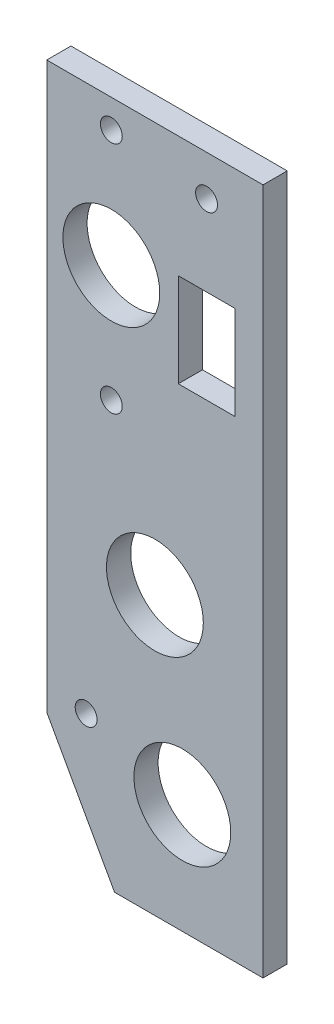
ISO-10303-21;
HEADER;
FILE_DESCRIPTION(('STEP AP214'),'2;1');
FILE_NAME('part.step','',(''),(''),'','','');
FILE_SCHEMA(('AUTOMOTIVE_DESIGN { 1 0 10303 214 1 1 1 1 }'));
ENDSEC;
DATA;
#1=APPLICATION_CONTEXT('core data for automotive mechanical design processes');
#2=APPLICATION_PROTOCOL_DEFINITION('international standard','automotive_design',2000,#1);
#3=PRODUCT_CONTEXT('',#1,'mechanical');
#4=PRODUCT('Part','Part','',(#3));
#5=PRODUCT_RELATED_PRODUCT_CATEGORY('part','',(#4));
#6=PRODUCT_DEFINITION_FORMATION('','',#4);
#7=PRODUCT_DEFINITION_CONTEXT('part definition',#1,'design');
#8=PRODUCT_DEFINITION('design','',#6,#7);
#9=PRODUCT_DEFINITION_SHAPE('','',#8);
#10=(LENGTH_UNIT() NAMED_UNIT(*) SI_UNIT(.MILLI.,.METRE.));
#11=(NAMED_UNIT(*) PLANE_ANGLE_UNIT() SI_UNIT($,.RADIAN.));
#12=(NAMED_UNIT(*) SI_UNIT($,.STERADIAN.) SOLID_ANGLE_UNIT());
#13=UNCERTAINTY_MEASURE_WITH_UNIT(LENGTH_MEASURE(1.E-05),#10,'distance_accuracy_value','');
#14=(GEOMETRIC_REPRESENTATION_CONTEXT(3) GLOBAL_UNCERTAINTY_ASSIGNED_CONTEXT((#13)) GLOBAL_UNIT_ASSIGNED_CONTEXT((#10,
#11,#12)) REPRESENTATION_CONTEXT('',''));
#15=CARTESIAN_POINT('',(0.,0.,0.));
#16=DIRECTION('',(0.,0.,1.));
#17=DIRECTION('',(1.,0.,0.));
#18=AXIS2_PLACEMENT_3D('',#15,#16,#17);
#19=CARTESIAN_POINT('',(-44.1325,26.9875,4.7625));
#20=DIRECTION('',(1.,0.,0.));
#21=DIRECTION('',(0.,1.,0.));
#22=AXIS2_PLACEMENT_3D('',#19,#20,#21);
#23=PLANE('',#22);
#24=DIRECTION('',(0.,-1.,0.));
#25=VECTOR('',#24,1.);
#26=CARTESIAN_POINT('',(-44.1325,26.9875,0.));
#27=LINE('',#26,#25);
#28=CARTESIAN_POINT('',(-44.1325,26.9875,0.));
#29=VERTEX_POINT('',#28);
#30=CARTESIAN_POINT('',(-44.1325,-84.1375,0.));
#31=VERTEX_POINT('',#30);
#32=EDGE_CURVE('E182',#29,#31,#27,.T.);
#33=ORIENTED_EDGE('',*,*,#32,.T.);
#34=DIRECTION('',(0.,0.,-1.));
#35=VECTOR('',#34,1.);
#36=CARTESIAN_POINT('',(-44.1325,-84.1375,4.7625));
#37=LINE('',#36,#35);
#38=CARTESIAN_POINT('',(-44.1325,-84.1375,4.7625));
#39=VERTEX_POINT('',#38);
#40=EDGE_CURVE('E13',#39,#31,#37,.T.);
#41=ORIENTED_EDGE('',*,*,#40,.F.);
#42=DIRECTION('',(0.,-1.,0.));
#43=VECTOR('',#42,1.);
#44=CARTESIAN_POINT('',(-44.1325,26.9875,4.7625));
#45=LINE('',#44,#43);
#46=CARTESIAN_POINT('',(-44.1325,26.9875,4.7625));
#47=VERTEX_POINT('',#46);
#48=EDGE_CURVE('E183',#47,#39,#45,.T.);
#49=ORIENTED_EDGE('',*,*,#48,.F.);
#50=DIRECTION('',(0.,0.,-1.));
#51=VECTOR('',#50,1.);
#52=CARTESIAN_POINT('',(-44.1325,26.9875,4.7625));
#53=LINE('',#52,#51);
#54=EDGE_CURVE('E195',#47,#29,#53,.T.);
#55=ORIENTED_EDGE('',*,*,#54,.T.);
#56=EDGE_LOOP('',(#33,#41,#49,#55));
#57=FACE_BOUND('',#56,.T.);
#58=ADVANCED_FACE('F55',(#57),#23,.F.);
#59=CARTESIAN_POINT('',(-44.1325,-84.1375,4.7625));
#60=DIRECTION('',(0.874157276121538,0.485642931178631,0.));
#61=DIRECTION('',(-0.485642931178631,0.874157276121538,0.));
#62=AXIS2_PLACEMENT_3D('',#59,#60,#61);
#63=PLANE('',#62);
#64=DIRECTION('',(0.485642931178631,-0.874157276121538,0.));
#65=VECTOR('',#64,1.);
#66=CARTESIAN_POINT('',(-44.1325,-84.1375,0.));
#67=LINE('',#66,#65);
#68=CARTESIAN_POINT('',(-30.7975,-108.1405,0.));
#69=VERTEX_POINT('',#68);
#70=EDGE_CURVE('E198',#31,#69,#67,.T.);
#71=ORIENTED_EDGE('',*,*,#70,.T.);
#72=DIRECTION('',(0.,0.,-1.));
#73=VECTOR('',#72,1.);
#74=CARTESIAN_POINT('',(-30.7975,-108.1405,4.7625));
#75=LINE('',#74,#73);
#76=CARTESIAN_POINT('',(-30.7975,-108.1405,4.7625));
#77=VERTEX_POINT('',#76);
#78=EDGE_CURVE('E62',#77,#69,#75,.T.);
#79=ORIENTED_EDGE('',*,*,#78,.F.);
#80=DIRECTION('',(0.485642931178631,-0.874157276121538,0.));
#81=VECTOR('',#80,1.);
#82=CARTESIAN_POINT('',(-44.1325,-84.1375,4.7625));
#83=LINE('',#82,#81);
#84=EDGE_CURVE('E186',#39,#77,#83,.T.);
#85=ORIENTED_EDGE('',*,*,#84,.F.);
#86=ORIENTED_EDGE('',*,*,#40,.T.);
#87=EDGE_LOOP('',(#71,#79,#85,#86));
#88=FACE_BOUND('',#87,.T.);
#89=ADVANCED_FACE('F236',(#88),#63,.F.);
#90=CARTESIAN_POINT('',(-30.7975,-108.1405,4.7625));
#91=DIRECTION('',(0.,1.,0.));
#92=DIRECTION('',(-1.,0.,0.));
#93=AXIS2_PLACEMENT_3D('',#90,#91,#92);
#94=PLANE('',#93);
#95=DIRECTION('',(1.,0.,0.));
#96=VECTOR('',#95,1.);
#97=CARTESIAN_POINT('',(-30.7975,-108.1405,0.));
#98=LINE('',#97,#96);
#99=CARTESIAN_POINT('',(-1.58750000000008,-108.1405,0.));
#100=VERTEX_POINT('',#99);
#101=EDGE_CURVE('E200',#69,#100,#98,.T.);
#102=ORIENTED_EDGE('',*,*,#101,.T.);
#103=DIRECTION('',(0.,0.,-1.));
#104=VECTOR('',#103,1.);
#105=CARTESIAN_POINT('',(-1.58750000000008,-108.1405,4.7625));
#106=LINE('',#105,#104);
#107=CARTESIAN_POINT('',(-1.58750000000008,-108.1405,4.7625));
#108=VERTEX_POINT('',#107);
#109=EDGE_CURVE('E210',#108,#100,#106,.T.);
#110=ORIENTED_EDGE('',*,*,#109,.F.);
#111=DIRECTION('',(1.,0.,0.));
#112=VECTOR('',#111,1.);
#113=CARTESIAN_POINT('',(-30.7975,-108.1405,4.7625));
#114=LINE('',#113,#112);
#115=EDGE_CURVE('E189',#77,#108,#114,.T.);
#116=ORIENTED_EDGE('',*,*,#115,.F.);
#117=ORIENTED_EDGE('',*,*,#78,.T.);
#118=EDGE_LOOP('',(#102,#110,#116,#117));
#119=FACE_BOUND('',#118,.T.);
#120=ADVANCED_FACE('F217',(#119),#94,.F.);
#121=CARTESIAN_POINT('',(-1.58750000000008,-108.1405,4.7625));
#122=DIRECTION('',(-1.,0.,0.));
#123=DIRECTION('',(0.,-1.,0.));
#124=AXIS2_PLACEMENT_3D('',#121,#122,#123);
#125=PLANE('',#124);
#126=DIRECTION('',(0.,1.,0.));
#127=VECTOR('',#126,1.);
#128=CARTESIAN_POINT('',(-1.58750000000008,-108.1405,0.));
#129=LINE('',#128,#127);
#130=CARTESIAN_POINT('',(-1.58750000000001,26.9875,0.));
#131=VERTEX_POINT('',#130);
#132=EDGE_CURVE('E202',#100,#131,#129,.T.);
#133=ORIENTED_EDGE('',*,*,#132,.T.);
#134=DIRECTION('',(0.,0.,-1.));
#135=VECTOR('',#134,1.);
#136=CARTESIAN_POINT('',(-1.58750000000001,26.9875,4.7625));
#137=LINE('',#136,#135);
#138=CARTESIAN_POINT('',(-1.58750000000001,26.9875,4.7625));
#139=VERTEX_POINT('',#138);
#140=EDGE_CURVE('E207',#139,#131,#137,.T.);
#141=ORIENTED_EDGE('',*,*,#140,.F.);
#142=DIRECTION('',(0.,1.,0.));
#143=VECTOR('',#142,1.);
#144=CARTESIAN_POINT('',(-1.58750000000008,-108.1405,4.7625));
#145=LINE('',#144,#143);
#146=EDGE_CURVE('E191',#108,#139,#145,.T.);
#147=ORIENTED_EDGE('',*,*,#146,.F.);
#148=ORIENTED_EDGE('',*,*,#109,.T.);
#149=EDGE_LOOP('',(#133,#141,#147,#148));
#150=FACE_BOUND('',#149,.T.);
#151=ADVANCED_FACE('F226',(#150),#125,.F.);
#152=CARTESIAN_POINT('',(-1.58750000000001,26.9875,4.7625));
#153=DIRECTION('',(0.,-1.,0.));
#154=DIRECTION('',(1.,0.,0.));
#155=AXIS2_PLACEMENT_3D('',#152,#153,#154);
#156=PLANE('',#155);
#157=DIRECTION('',(-1.,0.,0.));
#158=VECTOR('',#157,1.);
#159=CARTESIAN_POINT('',(-1.58750000000001,26.9875,0.));
#160=LINE('',#159,#158);
#161=EDGE_CURVE('E187',#131,#29,#160,.T.);
#162=ORIENTED_EDGE('',*,*,#161,.T.);
#163=ORIENTED_EDGE('',*,*,#54,.F.);
#164=DIRECTION('',(-1.,0.,0.));
#165=VECTOR('',#164,1.);
#166=CARTESIAN_POINT('',(-1.58750000000001,26.9875,4.7625));
#167=LINE('',#166,#165);
#168=EDGE_CURVE('E193',#139,#47,#167,.T.);
#169=ORIENTED_EDGE('',*,*,#168,.F.);
#170=ORIENTED_EDGE('',*,*,#140,.T.);
#171=EDGE_LOOP('',(#162,#163,#169,#170));
#172=FACE_BOUND('',#171,.T.);
#173=ADVANCED_FACE('F230',(#172),#156,.F.);
#174=CARTESIAN_POINT('',(0.,0.,4.7625));
#175=DIRECTION('',(0.,0.,1.));
#176=DIRECTION('',(1.,0.,0.));
#177=AXIS2_PLACEMENT_3D('',#174,#175,#176);
#178=PLANE('',#177);
#179=CARTESIAN_POINT('',(-36.3855,-80.4545,4.7625));
#180=DIRECTION('',(0.,0.,1.));
#181=DIRECTION('',(1.,0.,0.));
#182=AXIS2_PLACEMENT_3D('',#179,#180,#181);
#183=CIRCLE('',#182,2.15265);
#184=CARTESIAN_POINT('',(-34.23285,-80.4545,4.7625));
#185=VERTEX_POINT('',#184);
#186=EDGE_CURVE('E303',#185,#185,#183,.T.);
#187=ORIENTED_EDGE('',*,*,#186,.F.);
#188=EDGE_LOOP('',(#187));
#189=FACE_BOUND('',#188,.T.);
#190=CARTESIAN_POINT('',(-12.7,19.05,4.7625));
#191=DIRECTION('',(0.,0.,1.));
#192=DIRECTION('',(1.,0.,0.));
#193=AXIS2_PLACEMENT_3D('',#190,#191,#192);
#194=CIRCLE('',#193,2.15265);
#195=CARTESIAN_POINT('',(-10.54735,19.05,4.7625));
#196=VERTEX_POINT('',#195);
#197=EDGE_CURVE('E305',#196,#196,#194,.T.);
#198=ORIENTED_EDGE('',*,*,#197,.F.);
#199=EDGE_LOOP('',(#198));
#200=FACE_BOUND('',#199,.T.);
#201=CARTESIAN_POINT('',(-31.4324999999997,21.4047543880437,4.7625));
#202=DIRECTION('',(0.,0.,1.));
#203=DIRECTION('',(1.,0.,0.));
#204=AXIS2_PLACEMENT_3D('',#201,#202,#203);
#205=CIRCLE('',#204,2.15265);
#206=CARTESIAN_POINT('',(-29.2798499999997,21.4047543880437,4.7625));
#207=VERTEX_POINT('',#206);
#208=EDGE_CURVE('E313',#207,#207,#205,.T.);
#209=ORIENTED_EDGE('',*,*,#208,.F.);
#210=EDGE_LOOP('',(#209));
#211=FACE_BOUND('',#210,.T.);
#212=CARTESIAN_POINT('',(-31.4324999999997,-24.6200456119563,4.7625));
#213=DIRECTION('',(0.,0.,1.));
#214=DIRECTION('',(1.,0.,0.));
#215=AXIS2_PLACEMENT_3D('',#212,#213,#214);
#216=CIRCLE('',#215,2.15265);
#217=CARTESIAN_POINT('',(-29.2798499999997,-24.6200456119563,4.7625));
#218=VERTEX_POINT('',#217);
#219=EDGE_CURVE('E318',#218,#218,#216,.T.);
#220=ORIENTED_EDGE('',*,*,#219,.F.);
#221=EDGE_LOOP('',(#220));
#222=FACE_BOUND('',#221,.T.);
#223=DIRECTION('',(0.,-1.,0.));
#224=VECTOR('',#223,1.);
#225=CARTESIAN_POINT('',(-18.256250000001,3.17500000000266,4.7625));
#226=LINE('',#225,#224);
#227=CARTESIAN_POINT('',(-18.256250000001,3.17500000000266,4.7625));
#228=VERTEX_POINT('',#227);
#229=CARTESIAN_POINT('',(-18.256250000001,-15.2399999999973,4.7625));
#230=VERTEX_POINT('',#229);
#231=EDGE_CURVE('E69',#228,#230,#226,.T.);
#232=ORIENTED_EDGE('',*,*,#231,.F.);
#233=DIRECTION('',(-1.,0.,0.));
#234=VECTOR('',#233,1.);
#235=CARTESIAN_POINT('',(-18.256250000001,3.17500000000266,4.7625));
#236=LINE('',#235,#234);
#237=CARTESIAN_POINT('',(-7.143750000001,3.17500000000266,4.7625));
#238=VERTEX_POINT('',#237);
#239=EDGE_CURVE('E143',#238,#228,#236,.T.);
#240=ORIENTED_EDGE('',*,*,#239,.F.);
#241=DIRECTION('',(0.,1.,0.));
#242=VECTOR('',#241,1.);
#243=CARTESIAN_POINT('',(-7.143750000001,3.17500000000266,4.7625));
#244=LINE('',#243,#242);
#245=CARTESIAN_POINT('',(-7.143750000001,-15.2399999999973,4.7625));
#246=VERTEX_POINT('',#245);
#247=EDGE_CURVE('E146',#246,#238,#244,.T.);
#248=ORIENTED_EDGE('',*,*,#247,.F.);
#249=DIRECTION('',(1.,0.,0.));
#250=VECTOR('',#249,1.);
#251=CARTESIAN_POINT('',(-18.256250000001,-15.2399999999973,4.7625));
#252=LINE('',#251,#250);
#253=EDGE_CURVE('E155',#230,#246,#252,.T.);
#254=ORIENTED_EDGE('',*,*,#253,.F.);
#255=EDGE_LOOP('',(#232,#240,#248,#254));
#256=FACE_BOUND('',#255,.T.);
#257=CARTESIAN_POINT('',(-31.4324999999998,-1.62034561195612,4.7625));
#258=DIRECTION('',(0.,0.,1.));
#259=DIRECTION('',(1.,0.,0.));
#260=AXIS2_PLACEMENT_3D('',#257,#258,#259);
#261=CIRCLE('',#260,9.525);
#262=CARTESIAN_POINT('',(-21.9074999999998,-1.62034561195612,4.7625));
#263=VERTEX_POINT('',#262);
#264=EDGE_CURVE('E161',#263,#263,#261,.T.);
#265=ORIENTED_EDGE('',*,*,#264,.F.);
#266=EDGE_LOOP('',(#265));
#267=FACE_BOUND('',#266,.T.);
#268=CARTESIAN_POINT('',(-17.4624999999998,-86.5504999999962,4.7625));
#269=DIRECTION('',(0.,0.,1.));
#270=DIRECTION('',(1.,0.,0.));
#271=AXIS2_PLACEMENT_3D('',#268,#269,#270);
#272=CIRCLE('',#271,9.525);
#273=CARTESIAN_POINT('',(-7.93749999999977,-86.5504999999962,4.7625));
#274=VERTEX_POINT('',#273);
#275=EDGE_CURVE('E170',#274,#274,#272,.T.);
#276=ORIENTED_EDGE('',*,*,#275,.F.);
#277=EDGE_LOOP('',(#276));
#278=FACE_BOUND('',#277,.T.);
#279=CARTESIAN_POINT('',(-22.8599999999813,-53.5304999999975,4.7625));
#280=DIRECTION('',(0.,0.,1.));
#281=DIRECTION('',(1.,0.,0.));
#282=AXIS2_PLACEMENT_3D('',#279,#280,#281);
#283=CIRCLE('',#282,9.525);
#284=CARTESIAN_POINT('',(-13.3349999999813,-53.5304999999975,4.7625));
#285=VERTEX_POINT('',#284);
#286=EDGE_CURVE('E176',#285,#285,#283,.T.);
#287=ORIENTED_EDGE('',*,*,#286,.F.);
#288=EDGE_LOOP('',(#287));
#289=FACE_BOUND('',#288,.T.);
#290=ORIENTED_EDGE('',*,*,#48,.T.);
#291=ORIENTED_EDGE('',*,*,#84,.T.);
#292=ORIENTED_EDGE('',*,*,#115,.T.);
#293=ORIENTED_EDGE('',*,*,#146,.T.);
#294=ORIENTED_EDGE('',*,*,#168,.T.);
#295=EDGE_LOOP('',(#290,#291,#292,#293,#294));
#296=FACE_BOUND('',#295,.T.);
#297=ADVANCED_FACE('F234',(#189,#200,#211,#222,#256,#267,#278,#289,#296),#178,.T.);
#298=CARTESIAN_POINT('',(0.,0.,0.));
#299=DIRECTION('',(0.,0.,1.));
#300=DIRECTION('',(1.,0.,0.));
#301=AXIS2_PLACEMENT_3D('',#298,#299,#300);
#302=PLANE('',#301);
#303=CARTESIAN_POINT('',(-36.3855,-80.4545,0.));
#304=DIRECTION('',(0.,0.,1.));
#305=DIRECTION('',(1.,0.,0.));
#306=AXIS2_PLACEMENT_3D('',#303,#304,#305);
#307=CIRCLE('',#306,2.15265);
#308=CARTESIAN_POINT('',(-34.23285,-80.4545,0.));
#309=VERTEX_POINT('',#308);
#310=EDGE_CURVE('E300',#309,#309,#307,.T.);
#311=ORIENTED_EDGE('',*,*,#310,.T.);
#312=EDGE_LOOP('',(#311));
#313=FACE_BOUND('',#312,.T.);
#314=CARTESIAN_POINT('',(-12.7,19.05,0.));
#315=DIRECTION('',(0.,0.,1.));
#316=DIRECTION('',(1.,0.,0.));
#317=AXIS2_PLACEMENT_3D('',#314,#315,#316);
#318=CIRCLE('',#317,2.15265);
#319=CARTESIAN_POINT('',(-10.54735,19.05,0.));
#320=VERTEX_POINT('',#319);
#321=EDGE_CURVE('E310',#320,#320,#318,.T.);
#322=ORIENTED_EDGE('',*,*,#321,.T.);
#323=EDGE_LOOP('',(#322));
#324=FACE_BOUND('',#323,.T.);
#325=CARTESIAN_POINT('',(-31.4324999999997,21.4047543880437,0.));
#326=DIRECTION('',(0.,0.,1.));
#327=DIRECTION('',(1.,0.,0.));
#328=AXIS2_PLACEMENT_3D('',#325,#326,#327);
#329=CIRCLE('',#328,2.15265);
#330=CARTESIAN_POINT('',(-29.2798499999997,21.4047543880437,0.));
#331=VERTEX_POINT('',#330);
#332=EDGE_CURVE('E316',#331,#331,#329,.T.);
#333=ORIENTED_EDGE('',*,*,#332,.T.);
#334=EDGE_LOOP('',(#333));
#335=FACE_BOUND('',#334,.T.);
#336=CARTESIAN_POINT('',(-31.4324999999997,-24.6200456119563,0.));
#337=DIRECTION('',(0.,0.,1.));
#338=DIRECTION('',(1.,0.,0.));
#339=AXIS2_PLACEMENT_3D('',#336,#337,#338);
#340=CIRCLE('',#339,2.15265);
#341=CARTESIAN_POINT('',(-29.2798499999997,-24.6200456119563,0.));
#342=VERTEX_POINT('',#341);
#343=EDGE_CURVE('E149',#342,#342,#340,.T.);
#344=ORIENTED_EDGE('',*,*,#343,.T.);
#345=EDGE_LOOP('',(#344));
#346=FACE_BOUND('',#345,.T.);
#347=DIRECTION('',(-1.,0.,0.));
#348=VECTOR('',#347,1.);
#349=CARTESIAN_POINT('',(-18.256250000001,3.17500000000266,0.));
#350=LINE('',#349,#348);
#351=CARTESIAN_POINT('',(-7.143750000001,3.17500000000266,0.));
#352=VERTEX_POINT('',#351);
#353=CARTESIAN_POINT('',(-18.256250000001,3.17500000000266,0.));
#354=VERTEX_POINT('',#353);
#355=EDGE_CURVE('E133',#352,#354,#350,.T.);
#356=ORIENTED_EDGE('',*,*,#355,.T.);
#357=DIRECTION('',(0.,-1.,0.));
#358=VECTOR('',#357,1.);
#359=CARTESIAN_POINT('',(-18.256250000001,3.17500000000266,0.));
#360=LINE('',#359,#358);
#361=CARTESIAN_POINT('',(-18.256250000001,-15.2399999999973,0.));
#362=VERTEX_POINT('',#361);
#363=EDGE_CURVE('E127',#354,#362,#360,.T.);
#364=ORIENTED_EDGE('',*,*,#363,.T.);
#365=DIRECTION('',(1.,0.,0.));
#366=VECTOR('',#365,1.);
#367=CARTESIAN_POINT('',(-18.256250000001,-15.2399999999973,0.));
#368=LINE('',#367,#366);
#369=CARTESIAN_POINT('',(-7.143750000001,-15.2399999999973,0.));
#370=VERTEX_POINT('',#369);
#371=EDGE_CURVE('E136',#362,#370,#368,.T.);
#372=ORIENTED_EDGE('',*,*,#371,.T.);
#373=DIRECTION('',(0.,1.,0.));
#374=VECTOR('',#373,1.);
#375=CARTESIAN_POINT('',(-7.143750000001,3.17500000000266,0.));
#376=LINE('',#375,#374);
#377=EDGE_CURVE('E77',#370,#352,#376,.T.);
#378=ORIENTED_EDGE('',*,*,#377,.T.);
#379=EDGE_LOOP('',(#356,#364,#372,#378));
#380=FACE_BOUND('',#379,.T.);
#381=CARTESIAN_POINT('',(-31.4324999999998,-1.62034561195612,0.));
#382=DIRECTION('',(0.,0.,1.));
#383=DIRECTION('',(1.,0.,0.));
#384=AXIS2_PLACEMENT_3D('',#381,#382,#383);
#385=CIRCLE('',#384,9.525);
#386=CARTESIAN_POINT('',(-21.9074999999998,-1.62034561195612,0.));
#387=VERTEX_POINT('',#386);
#388=EDGE_CURVE('E167',#387,#387,#385,.T.);
#389=ORIENTED_EDGE('',*,*,#388,.T.);
#390=EDGE_LOOP('',(#389));
#391=FACE_BOUND('',#390,.T.);
#392=CARTESIAN_POINT('',(-17.4624999999998,-86.5504999999962,0.));
#393=DIRECTION('',(0.,0.,1.));
#394=DIRECTION('',(1.,0.,0.));
#395=AXIS2_PLACEMENT_3D('',#392,#393,#394);
#396=CIRCLE('',#395,9.525);
#397=CARTESIAN_POINT('',(-7.93749999999977,-86.5504999999962,0.));
#398=VERTEX_POINT('',#397);
#399=EDGE_CURVE('E173',#398,#398,#396,.T.);
#400=ORIENTED_EDGE('',*,*,#399,.T.);
#401=EDGE_LOOP('',(#400));
#402=FACE_BOUND('',#401,.T.);
#403=CARTESIAN_POINT('',(-22.8599999999813,-53.5304999999975,0.));
#404=DIRECTION('',(0.,0.,1.));
#405=DIRECTION('',(1.,0.,0.));
#406=AXIS2_PLACEMENT_3D('',#403,#404,#405);
#407=CIRCLE('',#406,9.525);
#408=CARTESIAN_POINT('',(-13.3349999999813,-53.5304999999975,0.));
#409=VERTEX_POINT('',#408);
#410=EDGE_CURVE('E179',#409,#409,#407,.T.);
#411=ORIENTED_EDGE('',*,*,#410,.T.);
#412=EDGE_LOOP('',(#411));
#413=FACE_BOUND('',#412,.T.);
#414=ORIENTED_EDGE('',*,*,#32,.F.);
#415=ORIENTED_EDGE('',*,*,#161,.F.);
#416=ORIENTED_EDGE('',*,*,#132,.F.);
#417=ORIENTED_EDGE('',*,*,#101,.F.);
#418=ORIENTED_EDGE('',*,*,#70,.F.);
#419=EDGE_LOOP('',(#414,#415,#416,#417,#418));
#420=FACE_BOUND('',#419,.T.);
#421=ADVANCED_FACE('F140',(#313,#324,#335,#346,#380,#391,#402,#413,#420),#302,.F.);
#422=CARTESIAN_POINT('',(-22.8599999999813,-53.5304999999975,4.7625));
#423=DIRECTION('',(0.,0.,1.));
#424=DIRECTION('',(1.,0.,0.));
#425=AXIS2_PLACEMENT_3D('',#422,#423,#424);
#426=CYLINDRICAL_SURFACE('',#425,9.525);
#427=ORIENTED_EDGE('',*,*,#410,.F.);
#428=EDGE_LOOP('',(#427));
#429=FACE_BOUND('',#428,.T.);
#430=ORIENTED_EDGE('',*,*,#286,.T.);
#431=EDGE_LOOP('',(#430));
#432=FACE_BOUND('',#431,.T.);
#433=ADVANCED_FACE('F253',(#429,#432),#426,.F.);
#434=CARTESIAN_POINT('',(-17.4624999999998,-86.5504999999962,4.7625));
#435=DIRECTION('',(0.,0.,1.));
#436=DIRECTION('',(1.,0.,0.));
#437=AXIS2_PLACEMENT_3D('',#434,#435,#436);
#438=CYLINDRICAL_SURFACE('',#437,9.525);
#439=ORIENTED_EDGE('',*,*,#399,.F.);
#440=EDGE_LOOP('',(#439));
#441=FACE_BOUND('',#440,.T.);
#442=ORIENTED_EDGE('',*,*,#275,.T.);
#443=EDGE_LOOP('',(#442));
#444=FACE_BOUND('',#443,.T.);
#445=ADVANCED_FACE('F260',(#441,#444),#438,.F.);
#446=CARTESIAN_POINT('',(-31.4324999999998,-1.62034561195612,4.7625));
#447=DIRECTION('',(0.,0.,1.));
#448=DIRECTION('',(1.,0.,0.));
#449=AXIS2_PLACEMENT_3D('',#446,#447,#448);
#450=CYLINDRICAL_SURFACE('',#449,9.525);
#451=ORIENTED_EDGE('',*,*,#388,.F.);
#452=EDGE_LOOP('',(#451));
#453=FACE_BOUND('',#452,.T.);
#454=ORIENTED_EDGE('',*,*,#264,.T.);
#455=EDGE_LOOP('',(#454));
#456=FACE_BOUND('',#455,.T.);
#457=ADVANCED_FACE('F264',(#453,#456),#450,.F.);
#458=CARTESIAN_POINT('',(-18.256250000001,3.17500000000266,0.));
#459=DIRECTION('',(-1.,0.,0.));
#460=DIRECTION('',(0.,0.,1.));
#461=AXIS2_PLACEMENT_3D('',#458,#459,#460);
#462=PLANE('',#461);
#463=ORIENTED_EDGE('',*,*,#231,.T.);
#464=DIRECTION('',(0.,0.,1.));
#465=VECTOR('',#464,1.);
#466=CARTESIAN_POINT('',(-18.256250000001,-15.2399999999973,0.));
#467=LINE('',#466,#465);
#468=EDGE_CURVE('E123',#362,#230,#467,.T.);
#469=ORIENTED_EDGE('',*,*,#468,.F.);
#470=ORIENTED_EDGE('',*,*,#363,.F.);
#471=DIRECTION('',(0.,0.,1.));
#472=VECTOR('',#471,1.);
#473=CARTESIAN_POINT('',(-18.256250000001,3.17500000000266,0.));
#474=LINE('',#473,#472);
#475=EDGE_CURVE('E159',#354,#228,#474,.T.);
#476=ORIENTED_EDGE('',*,*,#475,.T.);
#477=EDGE_LOOP('',(#463,#469,#470,#476));
#478=FACE_BOUND('',#477,.T.);
#479=ADVANCED_FACE('F125',(#478),#462,.F.);
#480=CARTESIAN_POINT('',(-18.256250000001,3.17500000000266,0.));
#481=DIRECTION('',(0.,1.,0.));
#482=DIRECTION('',(0.,0.,1.));
#483=AXIS2_PLACEMENT_3D('',#480,#481,#482);
#484=PLANE('',#483);
#485=ORIENTED_EDGE('',*,*,#239,.T.);
#486=ORIENTED_EDGE('',*,*,#475,.F.);
#487=ORIENTED_EDGE('',*,*,#355,.F.);
#488=DIRECTION('',(0.,0.,1.));
#489=VECTOR('',#488,1.);
#490=CARTESIAN_POINT('',(-7.143750000001,3.17500000000266,0.));
#491=LINE('',#490,#489);
#492=EDGE_CURVE('E162',#352,#238,#491,.T.);
#493=ORIENTED_EDGE('',*,*,#492,.T.);
#494=EDGE_LOOP('',(#485,#486,#487,#493));
#495=FACE_BOUND('',#494,.T.);
#496=ADVANCED_FACE('F271',(#495),#484,.F.);
#497=CARTESIAN_POINT('',(-7.143750000001,3.17500000000266,0.));
#498=DIRECTION('',(1.,0.,0.));
#499=DIRECTION('',(0.,0.,-1.));
#500=AXIS2_PLACEMENT_3D('',#497,#498,#499);
#501=PLANE('',#500);
#502=ORIENTED_EDGE('',*,*,#247,.T.);
#503=ORIENTED_EDGE('',*,*,#492,.F.);
#504=ORIENTED_EDGE('',*,*,#377,.F.);
#505=DIRECTION('',(0.,0.,1.));
#506=VECTOR('',#505,1.);
#507=CARTESIAN_POINT('',(-7.143750000001,-15.2399999999973,0.));
#508=LINE('',#507,#506);
#509=EDGE_CURVE('E132',#370,#246,#508,.T.);
#510=ORIENTED_EDGE('',*,*,#509,.T.);
#511=EDGE_LOOP('',(#502,#503,#504,#510));
#512=FACE_BOUND('',#511,.T.);
#513=ADVANCED_FACE('F275',(#512),#501,.F.);
#514=CARTESIAN_POINT('',(-18.256250000001,-15.2399999999973,0.));
#515=DIRECTION('',(0.,-1.,0.));
#516=DIRECTION('',(0.,0.,-1.));
#517=AXIS2_PLACEMENT_3D('',#514,#515,#516);
#518=PLANE('',#517);
#519=ORIENTED_EDGE('',*,*,#253,.T.);
#520=ORIENTED_EDGE('',*,*,#509,.F.);
#521=ORIENTED_EDGE('',*,*,#371,.F.);
#522=ORIENTED_EDGE('',*,*,#468,.T.);
#523=EDGE_LOOP('',(#519,#520,#521,#522));
#524=FACE_BOUND('',#523,.T.);
#525=ADVANCED_FACE('F137',(#524),#518,.F.);
#526=CARTESIAN_POINT('',(-31.4324999999997,-24.6200456119563,4.7625));
#527=DIRECTION('',(0.,0.,1.));
#528=DIRECTION('',(1.,0.,0.));
#529=AXIS2_PLACEMENT_3D('',#526,#527,#528);
#530=CYLINDRICAL_SURFACE('',#529,2.15265);
#531=ORIENTED_EDGE('',*,*,#343,.F.);
#532=EDGE_LOOP('',(#531));
#533=FACE_BOUND('',#532,.T.);
#534=ORIENTED_EDGE('',*,*,#219,.T.);
#535=EDGE_LOOP('',(#534));
#536=FACE_BOUND('',#535,.T.);
#537=ADVANCED_FACE('F274',(#533,#536),#530,.F.);
#538=CARTESIAN_POINT('',(-31.4324999999997,21.4047543880437,4.7625));
#539=DIRECTION('',(0.,0.,1.));
#540=DIRECTION('',(1.,0.,0.));
#541=AXIS2_PLACEMENT_3D('',#538,#539,#540);
#542=CYLINDRICAL_SURFACE('',#541,2.15265);
#543=ORIENTED_EDGE('',*,*,#332,.F.);
#544=EDGE_LOOP('',(#543));
#545=FACE_BOUND('',#544,.T.);
#546=ORIENTED_EDGE('',*,*,#208,.T.);
#547=EDGE_LOOP('',(#546));
#548=FACE_BOUND('',#547,.T.);
#549=ADVANCED_FACE('F283',(#545,#548),#542,.F.);
#550=CARTESIAN_POINT('',(-12.7,19.05,4.7625));
#551=DIRECTION('',(0.,0.,1.));
#552=DIRECTION('',(1.,0.,0.));
#553=AXIS2_PLACEMENT_3D('',#550,#551,#552);
#554=CYLINDRICAL_SURFACE('',#553,2.15265);
#555=ORIENTED_EDGE('',*,*,#321,.F.);
#556=EDGE_LOOP('',(#555));
#557=FACE_BOUND('',#556,.T.);
#558=ORIENTED_EDGE('',*,*,#197,.T.);
#559=EDGE_LOOP('',(#558));
#560=FACE_BOUND('',#559,.T.);
#561=ADVANCED_FACE('F287',(#557,#560),#554,.F.);
#562=CARTESIAN_POINT('',(-36.3855,-80.4545,4.7625));
#563=DIRECTION('',(0.,0.,1.));
#564=DIRECTION('',(1.,0.,0.));
#565=AXIS2_PLACEMENT_3D('',#562,#563,#564);
#566=CYLINDRICAL_SURFACE('',#565,2.15265);
#567=ORIENTED_EDGE('',*,*,#310,.F.);
#568=EDGE_LOOP('',(#567));
#569=FACE_BOUND('',#568,.T.);
#570=ORIENTED_EDGE('',*,*,#186,.T.);
#571=EDGE_LOOP('',(#570));
#572=FACE_BOUND('',#571,.T.);
#573=ADVANCED_FACE('F291',(#569,#572),#566,.F.);
#574=CLOSED_SHELL('',(#58,#89,#120,#151,#173,#297,#421,#433,#445,#457,#479,#496,#513,#525,#537,
#549,#561,#573));
#575=MANIFOLD_SOLID_BREP('B2',#574);
#576=ADVANCED_BREP_SHAPE_REPRESENTATION('',(#18,#575),#14);
#577=SHAPE_DEFINITION_REPRESENTATION(#9,#576);
ENDSEC;
END-ISO-10303-21;
